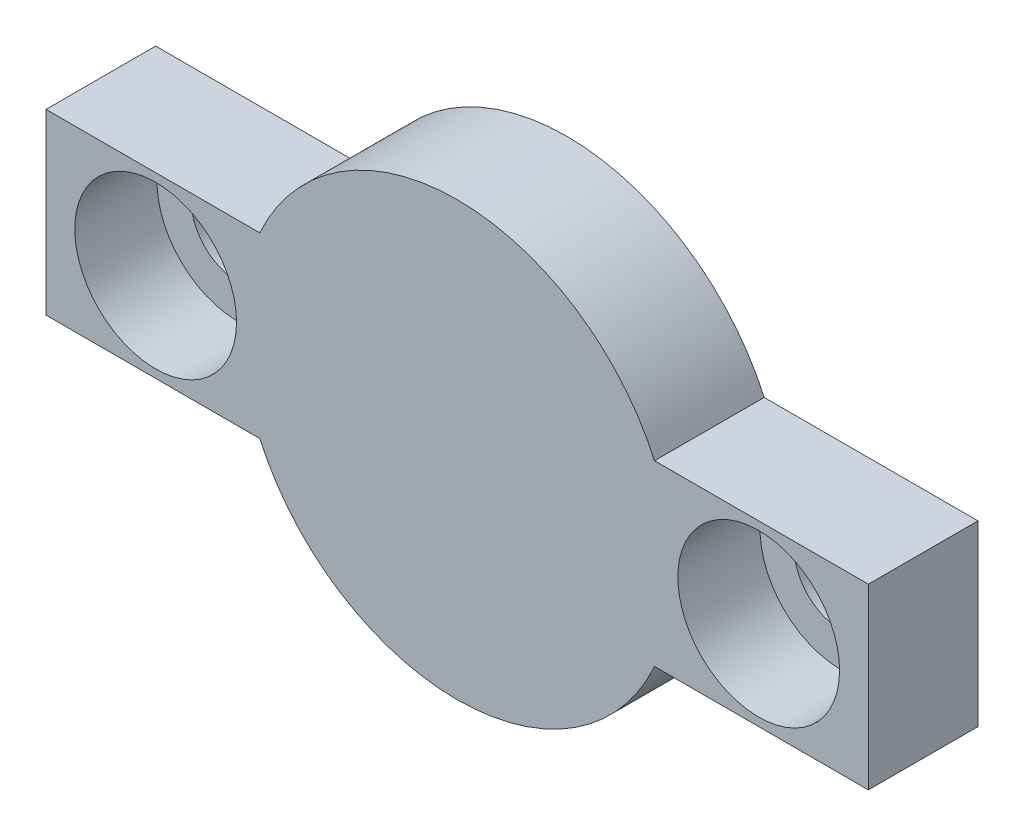
ISO-10303-21;
HEADER;
FILE_DESCRIPTION(('STEP AP214'),'2;1');
FILE_NAME('part.step','',(''),(''),'','','');
FILE_SCHEMA(('AUTOMOTIVE_DESIGN { 1 0 10303 214 1 1 1 1 }'));
ENDSEC;
DATA;
#1=APPLICATION_CONTEXT('core data for automotive mechanical design processes');
#2=APPLICATION_PROTOCOL_DEFINITION('international standard','automotive_design',2000,#1);
#3=PRODUCT_CONTEXT('',#1,'mechanical');
#4=PRODUCT('Part','Part','',(#3));
#5=PRODUCT_RELATED_PRODUCT_CATEGORY('part','',(#4));
#6=PRODUCT_DEFINITION_FORMATION('','',#4);
#7=PRODUCT_DEFINITION_CONTEXT('part definition',#1,'design');
#8=PRODUCT_DEFINITION('design','',#6,#7);
#9=PRODUCT_DEFINITION_SHAPE('','',#8);
#10=(LENGTH_UNIT() NAMED_UNIT(*) SI_UNIT(.MILLI.,.METRE.));
#11=(NAMED_UNIT(*) PLANE_ANGLE_UNIT() SI_UNIT($,.RADIAN.));
#12=(NAMED_UNIT(*) SI_UNIT($,.STERADIAN.) SOLID_ANGLE_UNIT());
#13=UNCERTAINTY_MEASURE_WITH_UNIT(LENGTH_MEASURE(1.E-05),#10,'distance_accuracy_value','');
#14=(GEOMETRIC_REPRESENTATION_CONTEXT(3) GLOBAL_UNCERTAINTY_ASSIGNED_CONTEXT((#13)) GLOBAL_UNIT_ASSIGNED_CONTEXT((#10,
#11,#12)) REPRESENTATION_CONTEXT('',''));
#15=CARTESIAN_POINT('',(0.,0.,0.));
#16=DIRECTION('',(0.,0.,1.));
#17=DIRECTION('',(1.,0.,0.));
#18=AXIS2_PLACEMENT_3D('',#15,#16,#17);
#19=CARTESIAN_POINT('',(11.,0.,0.));
#20=DIRECTION('',(0.,0.,1.));
#21=DIRECTION('',(1.,0.,0.));
#22=AXIS2_PLACEMENT_3D('',#19,#20,#21);
#23=CYLINDRICAL_SURFACE('',#22,1.7);
#24=CARTESIAN_POINT('',(11.,0.,0.));
#25=DIRECTION('',(0.,0.,1.));
#26=DIRECTION('',(1.,0.,0.));
#27=AXIS2_PLACEMENT_3D('',#24,#25,#26);
#28=CIRCLE('',#27,1.7);
#29=CARTESIAN_POINT('',(12.7,0.,0.));
#30=VERTEX_POINT('',#29);
#31=EDGE_CURVE('E167',#30,#30,#28,.T.);
#32=ORIENTED_EDGE('',*,*,#31,.F.);
#33=EDGE_LOOP('',(#32));
#34=FACE_BOUND('',#33,.T.);
#35=CARTESIAN_POINT('',(11.,0.,1.));
#36=DIRECTION('',(0.,0.,1.));
#37=DIRECTION('',(1.,0.,0.));
#38=AXIS2_PLACEMENT_3D('',#35,#36,#37);
#39=CIRCLE('',#38,1.7);
#40=CARTESIAN_POINT('',(12.7,0.,1.));
#41=VERTEX_POINT('',#40);
#42=EDGE_CURVE('E40',#41,#41,#39,.F.);
#43=ORIENTED_EDGE('',*,*,#42,.F.);
#44=EDGE_LOOP('',(#43));
#45=FACE_BOUND('',#44,.T.);
#46=ADVANCED_FACE('F36',(#34,#45),#23,.F.);
#47=CARTESIAN_POINT('',(-11.,0.,0.));
#48=DIRECTION('',(0.,0.,1.));
#49=DIRECTION('',(1.,0.,0.));
#50=AXIS2_PLACEMENT_3D('',#47,#48,#49);
#51=CYLINDRICAL_SURFACE('',#50,1.7);
#52=CARTESIAN_POINT('',(-11.,0.,0.));
#53=DIRECTION('',(0.,0.,1.));
#54=DIRECTION('',(1.,0.,0.));
#55=AXIS2_PLACEMENT_3D('',#52,#53,#54);
#56=CIRCLE('',#55,1.7);
#57=CARTESIAN_POINT('',(-9.3,0.,0.));
#58=VERTEX_POINT('',#57);
#59=EDGE_CURVE('E139',#58,#58,#56,.T.);
#60=ORIENTED_EDGE('',*,*,#59,.F.);
#61=EDGE_LOOP('',(#60));
#62=FACE_BOUND('',#61,.T.);
#63=CARTESIAN_POINT('',(-11.,0.,1.));
#64=DIRECTION('',(0.,0.,1.));
#65=DIRECTION('',(1.,0.,0.));
#66=AXIS2_PLACEMENT_3D('',#63,#64,#65);
#67=CIRCLE('',#66,1.7);
#68=CARTESIAN_POINT('',(-9.3,0.,1.));
#69=VERTEX_POINT('',#68);
#70=EDGE_CURVE('E161',#69,#69,#67,.F.);
#71=ORIENTED_EDGE('',*,*,#70,.F.);
#72=EDGE_LOOP('',(#71));
#73=FACE_BOUND('',#72,.T.);
#74=ADVANCED_FACE('F220',(#62,#73),#51,.F.);
#75=CARTESIAN_POINT('',(0.,0.,4.));
#76=DIRECTION('',(0.,0.,-1.));
#77=DIRECTION('',(-1.,0.,0.));
#78=AXIS2_PLACEMENT_3D('',#75,#76,#77);
#79=CYLINDRICAL_SURFACE('',#78,7.9);
#80=CARTESIAN_POINT('',(0.,0.,0.));
#81=DIRECTION('',(0.,0.,1.));
#82=DIRECTION('',(1.,0.,0.));
#83=AXIS2_PLACEMENT_3D('',#80,#81,#82);
#84=CIRCLE('',#83,7.9);
#85=CARTESIAN_POINT('',(7.20052081449669,3.25,0.));
#86=VERTEX_POINT('',#85);
#87=CARTESIAN_POINT('',(-7.20052081449669,3.25,0.));
#88=VERTEX_POINT('',#87);
#89=EDGE_CURVE('E135',#86,#88,#84,.T.);
#90=ORIENTED_EDGE('',*,*,#89,.T.);
#91=DIRECTION('',(0.,0.,-1.));
#92=VECTOR('',#91,1.);
#93=CARTESIAN_POINT('',(-7.20052081449669,3.25,4.));
#94=LINE('',#93,#92);
#95=CARTESIAN_POINT('',(-7.20052081449669,3.25,4.));
#96=VERTEX_POINT('',#95);
#97=EDGE_CURVE('E11',#96,#88,#94,.T.);
#98=ORIENTED_EDGE('',*,*,#97,.F.);
#99=CARTESIAN_POINT('',(0.,0.,4.));
#100=DIRECTION('',(0.,0.,1.));
#101=DIRECTION('',(1.,0.,0.));
#102=AXIS2_PLACEMENT_3D('',#99,#100,#101);
#103=CIRCLE('',#102,7.9);
#104=CARTESIAN_POINT('',(7.20052081449669,3.25,4.));
#105=VERTEX_POINT('',#104);
#106=EDGE_CURVE('E150',#105,#96,#103,.T.);
#107=ORIENTED_EDGE('',*,*,#106,.F.);
#108=DIRECTION('',(0.,0.,-1.));
#109=VECTOR('',#108,1.);
#110=CARTESIAN_POINT('',(7.20052081449669,3.25,4.));
#111=LINE('',#110,#109);
#112=EDGE_CURVE('E131',#105,#86,#111,.T.);
#113=ORIENTED_EDGE('',*,*,#112,.T.);
#114=EDGE_LOOP('',(#90,#98,#107,#113));
#115=FACE_BOUND('',#114,.T.);
#116=ADVANCED_FACE('F38',(#115),#79,.T.);
#117=CARTESIAN_POINT('',(-7.20052081449669,3.25,4.));
#118=DIRECTION('',(0.,-1.,0.));
#119=DIRECTION('',(1.,0.,0.));
#120=AXIS2_PLACEMENT_3D('',#117,#118,#119);
#121=PLANE('',#120);
#122=DIRECTION('',(-1.,0.,0.));
#123=VECTOR('',#122,1.);
#124=CARTESIAN_POINT('',(-7.20052081449669,3.25,0.));
#125=LINE('',#124,#123);
#126=CARTESIAN_POINT('',(-15.,3.25,0.));
#127=VERTEX_POINT('',#126);
#128=EDGE_CURVE('E138',#88,#127,#125,.T.);
#129=ORIENTED_EDGE('',*,*,#128,.T.);
#130=DIRECTION('',(0.,0.,-1.));
#131=VECTOR('',#130,1.);
#132=CARTESIAN_POINT('',(-15.,3.25,4.));
#133=LINE('',#132,#131);
#134=CARTESIAN_POINT('',(-15.,3.25,4.));
#135=VERTEX_POINT('',#134);
#136=EDGE_CURVE('E46',#135,#127,#133,.T.);
#137=ORIENTED_EDGE('',*,*,#136,.F.);
#138=DIRECTION('',(-1.,0.,0.));
#139=VECTOR('',#138,1.);
#140=CARTESIAN_POINT('',(-7.20052081449669,3.25,4.));
#141=LINE('',#140,#139);
#142=EDGE_CURVE('E98',#96,#135,#141,.T.);
#143=ORIENTED_EDGE('',*,*,#142,.F.);
#144=ORIENTED_EDGE('',*,*,#97,.T.);
#145=EDGE_LOOP('',(#129,#137,#143,#144));
#146=FACE_BOUND('',#145,.T.);
#147=ADVANCED_FACE('F339',(#146),#121,.F.);
#148=CARTESIAN_POINT('',(-15.,-3.25,4.));
#149=DIRECTION('',(1.,0.,0.));
#150=DIRECTION('',(0.,0.,-1.));
#151=AXIS2_PLACEMENT_3D('',#148,#149,#150);
#152=PLANE('',#151);
#153=DIRECTION('',(0.,-1.,0.));
#154=VECTOR('',#153,1.);
#155=CARTESIAN_POINT('',(-15.,-3.25,0.));
#156=LINE('',#155,#154);
#157=CARTESIAN_POINT('',(-15.,-3.25,0.));
#158=VERTEX_POINT('',#157);
#159=EDGE_CURVE('E141',#127,#158,#156,.T.);
#160=ORIENTED_EDGE('',*,*,#159,.T.);
#161=DIRECTION('',(0.,0.,-1.));
#162=VECTOR('',#161,1.);
#163=CARTESIAN_POINT('',(-15.,-3.25,4.));
#164=LINE('',#163,#162);
#165=CARTESIAN_POINT('',(-15.,-3.25,4.));
#166=VERTEX_POINT('',#165);
#167=EDGE_CURVE('E157',#166,#158,#164,.T.);
#168=ORIENTED_EDGE('',*,*,#167,.F.);
#169=DIRECTION('',(0.,-1.,0.));
#170=VECTOR('',#169,1.);
#171=CARTESIAN_POINT('',(-15.,-3.25,4.));
#172=LINE('',#171,#170);
#173=EDGE_CURVE('E188',#135,#166,#172,.T.);
#174=ORIENTED_EDGE('',*,*,#173,.F.);
#175=ORIENTED_EDGE('',*,*,#136,.T.);
#176=EDGE_LOOP('',(#160,#168,#174,#175));
#177=FACE_BOUND('',#176,.T.);
#178=ADVANCED_FACE('F330',(#177),#152,.F.);
#179=CARTESIAN_POINT('',(-7.20052081449669,-3.25,4.));
#180=DIRECTION('',(0.,1.,0.));
#181=DIRECTION('',(-1.,0.,0.));
#182=AXIS2_PLACEMENT_3D('',#179,#180,#181);
#183=PLANE('',#182);
#184=DIRECTION('',(1.,0.,0.));
#185=VECTOR('',#184,1.);
#186=CARTESIAN_POINT('',(-7.20052081449669,-3.25,0.));
#187=LINE('',#186,#185);
#188=CARTESIAN_POINT('',(-7.20052081449669,-3.25,0.));
#189=VERTEX_POINT('',#188);
#190=EDGE_CURVE('E143',#158,#189,#187,.T.);
#191=ORIENTED_EDGE('',*,*,#190,.T.);
#192=DIRECTION('',(0.,0.,-1.));
#193=VECTOR('',#192,1.);
#194=CARTESIAN_POINT('',(-7.20052081449669,-3.25,4.));
#195=LINE('',#194,#193);
#196=CARTESIAN_POINT('',(-7.20052081449669,-3.25,4.));
#197=VERTEX_POINT('',#196);
#198=EDGE_CURVE('E154',#197,#189,#195,.T.);
#199=ORIENTED_EDGE('',*,*,#198,.F.);
#200=DIRECTION('',(1.,0.,0.));
#201=VECTOR('',#200,1.);
#202=CARTESIAN_POINT('',(-7.20052081449669,-3.25,4.));
#203=LINE('',#202,#201);
#204=EDGE_CURVE('E190',#166,#197,#203,.T.);
#205=ORIENTED_EDGE('',*,*,#204,.F.);
#206=ORIENTED_EDGE('',*,*,#167,.T.);
#207=EDGE_LOOP('',(#191,#199,#205,#206));
#208=FACE_BOUND('',#207,.T.);
#209=ADVANCED_FACE('F196',(#208),#183,.F.);
#210=CARTESIAN_POINT('',(0.,0.,4.));
#211=DIRECTION('',(0.,0.,-1.));
#212=DIRECTION('',(-1.,0.,0.));
#213=AXIS2_PLACEMENT_3D('',#210,#211,#212);
#214=CYLINDRICAL_SURFACE('',#213,7.9);
#215=CARTESIAN_POINT('',(0.,0.,0.));
#216=DIRECTION('',(0.,0.,1.));
#217=DIRECTION('',(1.,0.,0.));
#218=AXIS2_PLACEMENT_3D('',#215,#216,#217);
#219=CIRCLE('',#218,7.9);
#220=CARTESIAN_POINT('',(7.20052081449668,-3.25,0.));
#221=VERTEX_POINT('',#220);
#222=EDGE_CURVE('E145',#189,#221,#219,.T.);
#223=ORIENTED_EDGE('',*,*,#222,.T.);
#224=DIRECTION('',(0.,0.,-1.));
#225=VECTOR('',#224,1.);
#226=CARTESIAN_POINT('',(7.20052081449668,-3.25,4.));
#227=LINE('',#226,#225);
#228=CARTESIAN_POINT('',(7.20052081449668,-3.25,4.));
#229=VERTEX_POINT('',#228);
#230=EDGE_CURVE('E126',#229,#221,#227,.T.);
#231=ORIENTED_EDGE('',*,*,#230,.F.);
#232=CARTESIAN_POINT('',(0.,0.,4.));
#233=DIRECTION('',(0.,0.,1.));
#234=DIRECTION('',(1.,0.,0.));
#235=AXIS2_PLACEMENT_3D('',#232,#233,#234);
#236=CIRCLE('',#235,7.9);
#237=EDGE_CURVE('E117',#197,#229,#236,.T.);
#238=ORIENTED_EDGE('',*,*,#237,.F.);
#239=ORIENTED_EDGE('',*,*,#198,.T.);
#240=EDGE_LOOP('',(#223,#231,#238,#239));
#241=FACE_BOUND('',#240,.T.);
#242=ADVANCED_FACE('F200',(#241),#214,.T.);
#243=CARTESIAN_POINT('',(15.,-3.25,4.));
#244=DIRECTION('',(0.,1.,0.));
#245=DIRECTION('',(-1.,0.,0.));
#246=AXIS2_PLACEMENT_3D('',#243,#244,#245);
#247=PLANE('',#246);
#248=DIRECTION('',(1.,0.,0.));
#249=VECTOR('',#248,1.);
#250=CARTESIAN_POINT('',(15.,-3.25,0.));
#251=LINE('',#250,#249);
#252=CARTESIAN_POINT('',(15.,-3.25,0.));
#253=VERTEX_POINT('',#252);
#254=EDGE_CURVE('E125',#221,#253,#251,.T.);
#255=ORIENTED_EDGE('',*,*,#254,.T.);
#256=DIRECTION('',(0.,0.,-1.));
#257=VECTOR('',#256,1.);
#258=CARTESIAN_POINT('',(15.,-3.25,4.));
#259=LINE('',#258,#257);
#260=CARTESIAN_POINT('',(15.,-3.25,4.));
#261=VERTEX_POINT('',#260);
#262=EDGE_CURVE('E122',#261,#253,#259,.T.);
#263=ORIENTED_EDGE('',*,*,#262,.F.);
#264=DIRECTION('',(1.,0.,0.));
#265=VECTOR('',#264,1.);
#266=CARTESIAN_POINT('',(15.,-3.25,4.));
#267=LINE('',#266,#265);
#268=EDGE_CURVE('E111',#229,#261,#267,.T.);
#269=ORIENTED_EDGE('',*,*,#268,.F.);
#270=ORIENTED_EDGE('',*,*,#230,.T.);
#271=EDGE_LOOP('',(#255,#263,#269,#270));
#272=FACE_BOUND('',#271,.T.);
#273=ADVANCED_FACE('F123',(#272),#247,.F.);
#274=CARTESIAN_POINT('',(15.,-3.25,4.));
#275=DIRECTION('',(-1.,0.,0.));
#276=DIRECTION('',(0.,0.,1.));
#277=AXIS2_PLACEMENT_3D('',#274,#275,#276);
#278=PLANE('',#277);
#279=DIRECTION('',(0.,1.,0.));
#280=VECTOR('',#279,1.);
#281=CARTESIAN_POINT('',(15.,-3.25,0.));
#282=LINE('',#281,#280);
#283=CARTESIAN_POINT('',(15.,3.25,0.));
#284=VERTEX_POINT('',#283);
#285=EDGE_CURVE('E84',#253,#284,#282,.T.);
#286=ORIENTED_EDGE('',*,*,#285,.T.);
#287=DIRECTION('',(0.,0.,-1.));
#288=VECTOR('',#287,1.);
#289=CARTESIAN_POINT('',(15.,3.25,4.));
#290=LINE('',#289,#288);
#291=CARTESIAN_POINT('',(15.,3.25,4.));
#292=VERTEX_POINT('',#291);
#293=EDGE_CURVE('E127',#292,#284,#290,.T.);
#294=ORIENTED_EDGE('',*,*,#293,.F.);
#295=DIRECTION('',(0.,1.,0.));
#296=VECTOR('',#295,1.);
#297=CARTESIAN_POINT('',(15.,-3.25,4.));
#298=LINE('',#297,#296);
#299=EDGE_CURVE('E115',#261,#292,#298,.T.);
#300=ORIENTED_EDGE('',*,*,#299,.F.);
#301=ORIENTED_EDGE('',*,*,#262,.T.);
#302=EDGE_LOOP('',(#286,#294,#300,#301));
#303=FACE_BOUND('',#302,.T.);
#304=ADVANCED_FACE('F129',(#303),#278,.F.);
#305=CARTESIAN_POINT('',(15.,3.25,4.));
#306=DIRECTION('',(0.,-1.,0.));
#307=DIRECTION('',(1.,0.,0.));
#308=AXIS2_PLACEMENT_3D('',#305,#306,#307);
#309=PLANE('',#308);
#310=DIRECTION('',(-1.,0.,0.));
#311=VECTOR('',#310,1.);
#312=CARTESIAN_POINT('',(15.,3.25,0.));
#313=LINE('',#312,#311);
#314=EDGE_CURVE('E90',#284,#86,#313,.T.);
#315=ORIENTED_EDGE('',*,*,#314,.T.);
#316=ORIENTED_EDGE('',*,*,#112,.F.);
#317=DIRECTION('',(-1.,0.,0.));
#318=VECTOR('',#317,1.);
#319=CARTESIAN_POINT('',(15.,3.25,4.));
#320=LINE('',#319,#318);
#321=EDGE_CURVE('E55',#292,#105,#320,.T.);
#322=ORIENTED_EDGE('',*,*,#321,.F.);
#323=ORIENTED_EDGE('',*,*,#293,.T.);
#324=EDGE_LOOP('',(#315,#316,#322,#323));
#325=FACE_BOUND('',#324,.T.);
#326=ADVANCED_FACE('F208',(#325),#309,.F.);
#327=CARTESIAN_POINT('',(0.,0.,4.));
#328=DIRECTION('',(0.,0.,1.));
#329=DIRECTION('',(1.,0.,0.));
#330=AXIS2_PLACEMENT_3D('',#327,#328,#329);
#331=PLANE('',#330);
#332=CARTESIAN_POINT('',(-11.,0.,4.));
#333=DIRECTION('',(0.,0.,1.));
#334=DIRECTION('',(1.,0.,0.));
#335=AXIS2_PLACEMENT_3D('',#332,#333,#334);
#336=CIRCLE('',#335,2.95);
#337=CARTESIAN_POINT('',(-8.05,0.,4.));
#338=VERTEX_POINT('',#337);
#339=EDGE_CURVE('E169',#338,#338,#336,.T.);
#340=ORIENTED_EDGE('',*,*,#339,.F.);
#341=EDGE_LOOP('',(#340));
#342=FACE_BOUND('',#341,.T.);
#343=CARTESIAN_POINT('',(11.,0.,4.));
#344=DIRECTION('',(0.,0.,1.));
#345=DIRECTION('',(1.,0.,0.));
#346=AXIS2_PLACEMENT_3D('',#343,#344,#345);
#347=CIRCLE('',#346,2.95);
#348=CARTESIAN_POINT('',(13.95,0.,4.));
#349=VERTEX_POINT('',#348);
#350=EDGE_CURVE('E179',#349,#349,#347,.T.);
#351=ORIENTED_EDGE('',*,*,#350,.F.);
#352=EDGE_LOOP('',(#351));
#353=FACE_BOUND('',#352,.T.);
#354=ORIENTED_EDGE('',*,*,#106,.T.);
#355=ORIENTED_EDGE('',*,*,#142,.T.);
#356=ORIENTED_EDGE('',*,*,#173,.T.);
#357=ORIENTED_EDGE('',*,*,#204,.T.);
#358=ORIENTED_EDGE('',*,*,#237,.T.);
#359=ORIENTED_EDGE('',*,*,#268,.T.);
#360=ORIENTED_EDGE('',*,*,#299,.T.);
#361=ORIENTED_EDGE('',*,*,#321,.T.);
#362=EDGE_LOOP('',(#354,#355,#356,#357,#358,#359,#360,#361));
#363=FACE_BOUND('',#362,.T.);
#364=ADVANCED_FACE('F113',(#342,#353,#363),#331,.T.);
#365=CARTESIAN_POINT('',(0.,0.,0.));
#366=DIRECTION('',(0.,0.,1.));
#367=DIRECTION('',(1.,0.,0.));
#368=AXIS2_PLACEMENT_3D('',#365,#366,#367);
#369=PLANE('',#368);
#370=ORIENTED_EDGE('',*,*,#59,.T.);
#371=EDGE_LOOP('',(#370));
#372=FACE_BOUND('',#371,.T.);
#373=ORIENTED_EDGE('',*,*,#31,.T.);
#374=EDGE_LOOP('',(#373));
#375=FACE_BOUND('',#374,.T.);
#376=ORIENTED_EDGE('',*,*,#89,.F.);
#377=ORIENTED_EDGE('',*,*,#314,.F.);
#378=ORIENTED_EDGE('',*,*,#285,.F.);
#379=ORIENTED_EDGE('',*,*,#254,.F.);
#380=ORIENTED_EDGE('',*,*,#222,.F.);
#381=ORIENTED_EDGE('',*,*,#190,.F.);
#382=ORIENTED_EDGE('',*,*,#159,.F.);
#383=ORIENTED_EDGE('',*,*,#128,.F.);
#384=EDGE_LOOP('',(#376,#377,#378,#379,#380,#381,#382,#383));
#385=FACE_BOUND('',#384,.T.);
#386=ADVANCED_FACE('F203',(#372,#375,#385),#369,.F.);
#387=CARTESIAN_POINT('',(-11.,0.,1.));
#388=DIRECTION('',(0.,0.,1.));
#389=DIRECTION('',(1.,0.,0.));
#390=AXIS2_PLACEMENT_3D('',#387,#388,#389);
#391=PLANE('',#390);
#392=CARTESIAN_POINT('',(-11.,0.,1.));
#393=DIRECTION('',(0.,0.,1.));
#394=DIRECTION('',(1.,0.,0.));
#395=AXIS2_PLACEMENT_3D('',#392,#393,#394);
#396=CIRCLE('',#395,2.95);
#397=CARTESIAN_POINT('',(-8.05,0.,1.));
#398=VERTEX_POINT('',#397);
#399=EDGE_CURVE('E163',#398,#398,#396,.T.);
#400=ORIENTED_EDGE('',*,*,#399,.T.);
#401=EDGE_LOOP('',(#400));
#402=FACE_BOUND('',#401,.T.);
#403=ORIENTED_EDGE('',*,*,#70,.T.);
#404=EDGE_LOOP('',(#403));
#405=FACE_BOUND('',#404,.T.);
#406=ADVANCED_FACE('F232',(#402,#405),#391,.T.);
#407=CARTESIAN_POINT('',(-11.,0.,1.));
#408=DIRECTION('',(0.,0.,1.));
#409=DIRECTION('',(1.,0.,0.));
#410=AXIS2_PLACEMENT_3D('',#407,#408,#409);
#411=CYLINDRICAL_SURFACE('',#410,2.95);
#412=ORIENTED_EDGE('',*,*,#399,.F.);
#413=EDGE_LOOP('',(#412));
#414=FACE_BOUND('',#413,.T.);
#415=ORIENTED_EDGE('',*,*,#339,.T.);
#416=EDGE_LOOP('',(#415));
#417=FACE_BOUND('',#416,.T.);
#418=ADVANCED_FACE('F237',(#414,#417),#411,.F.);
#419=CARTESIAN_POINT('',(11.,0.,1.));
#420=DIRECTION('',(0.,0.,1.));
#421=DIRECTION('',(1.,0.,0.));
#422=AXIS2_PLACEMENT_3D('',#419,#420,#421);
#423=PLANE('',#422);
#424=CARTESIAN_POINT('',(11.,0.,1.));
#425=DIRECTION('',(0.,0.,1.));
#426=DIRECTION('',(1.,0.,0.));
#427=AXIS2_PLACEMENT_3D('',#424,#425,#426);
#428=CIRCLE('',#427,2.95);
#429=CARTESIAN_POINT('',(13.95,0.,1.));
#430=VERTEX_POINT('',#429);
#431=EDGE_CURVE('E174',#430,#430,#428,.T.);
#432=ORIENTED_EDGE('',*,*,#431,.T.);
#433=EDGE_LOOP('',(#432));
#434=FACE_BOUND('',#433,.T.);
#435=ORIENTED_EDGE('',*,*,#42,.T.);
#436=EDGE_LOOP('',(#435));
#437=FACE_BOUND('',#436,.T.);
#438=ADVANCED_FACE('F245',(#434,#437),#423,.T.);
#439=CARTESIAN_POINT('',(11.,0.,1.));
#440=DIRECTION('',(0.,0.,1.));
#441=DIRECTION('',(1.,0.,0.));
#442=AXIS2_PLACEMENT_3D('',#439,#440,#441);
#443=CYLINDRICAL_SURFACE('',#442,2.95);
#444=ORIENTED_EDGE('',*,*,#431,.F.);
#445=EDGE_LOOP('',(#444));
#446=FACE_BOUND('',#445,.T.);
#447=ORIENTED_EDGE('',*,*,#350,.T.);
#448=EDGE_LOOP('',(#447));
#449=FACE_BOUND('',#448,.T.);
#450=ADVANCED_FACE('F250',(#446,#449),#443,.F.);
#451=CLOSED_SHELL('',(#46,#74,#116,#147,#178,#209,#242,#273,#304,#326,#364,#386,#406,#418,#438,#450));
#452=MANIFOLD_SOLID_BREP('B2',#451);
#453=ADVANCED_BREP_SHAPE_REPRESENTATION('',(#18,#452),#14);
#454=SHAPE_DEFINITION_REPRESENTATION(#9,#453);
ENDSEC;
END-ISO-10303-21;
